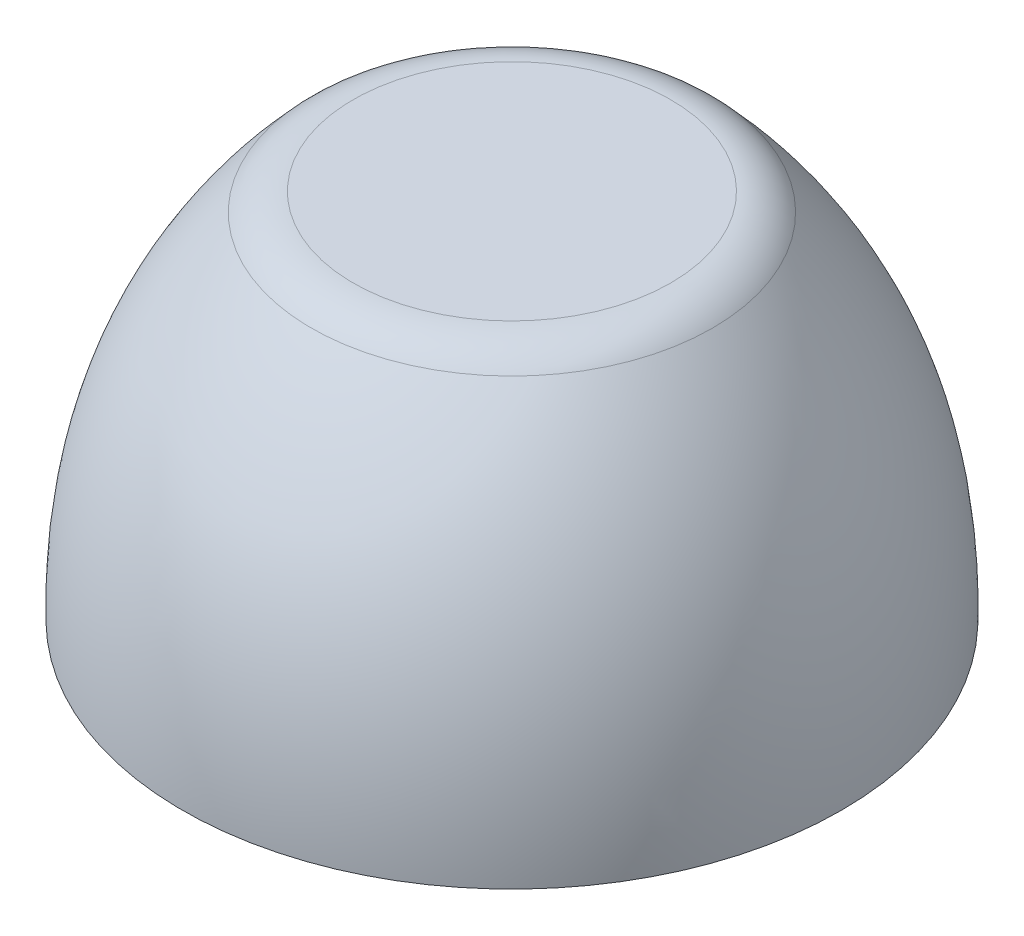
ISO-10303-21;
HEADER;
FILE_DESCRIPTION(('STEP AP214'),'2;1');
FILE_NAME('part.step','',(''),(''),'','','');
FILE_SCHEMA(('AUTOMOTIVE_DESIGN { 1 0 10303 214 1 1 1 1 }'));
ENDSEC;
DATA;
#1=APPLICATION_CONTEXT('core data for automotive mechanical design processes');
#2=APPLICATION_PROTOCOL_DEFINITION('international standard','automotive_design',2000,#1);
#3=PRODUCT_CONTEXT('',#1,'mechanical');
#4=PRODUCT('Part','Part','',(#3));
#5=PRODUCT_RELATED_PRODUCT_CATEGORY('part','',(#4));
#6=PRODUCT_DEFINITION_FORMATION('','',#4);
#7=PRODUCT_DEFINITION_CONTEXT('part definition',#1,'design');
#8=PRODUCT_DEFINITION('design','',#6,#7);
#9=PRODUCT_DEFINITION_SHAPE('','',#8);
#10=(LENGTH_UNIT() NAMED_UNIT(*) SI_UNIT(.MILLI.,.METRE.));
#11=(NAMED_UNIT(*) PLANE_ANGLE_UNIT() SI_UNIT($,.RADIAN.));
#12=(NAMED_UNIT(*) SI_UNIT($,.STERADIAN.) SOLID_ANGLE_UNIT());
#13=UNCERTAINTY_MEASURE_WITH_UNIT(LENGTH_MEASURE(1.E-05),#10,'distance_accuracy_value','');
#14=(GEOMETRIC_REPRESENTATION_CONTEXT(3) GLOBAL_UNCERTAINTY_ASSIGNED_CONTEXT((#13)) GLOBAL_UNIT_ASSIGNED_CONTEXT((#10,
#11,#12)) REPRESENTATION_CONTEXT('',''));
#15=CARTESIAN_POINT('',(0.,0.,0.));
#16=DIRECTION('',(0.,0.,1.));
#17=DIRECTION('',(1.,0.,0.));
#18=AXIS2_PLACEMENT_3D('',#15,#16,#17);
#19=CARTESIAN_POINT('',(-0.576727971236533,0.,0.));
#20=DIRECTION('',(0.,1.,0.));
#21=DIRECTION('',(-1.,0.,0.));
#22=AXIS2_PLACEMENT_3D('',#19,#20,#21);
#23=PLANE('',#22);
#24=CARTESIAN_POINT('',(0.,0.,0.));
#25=DIRECTION('',(0.,-1.,0.));
#26=DIRECTION('',(1.,0.,0.));
#27=AXIS2_PLACEMENT_3D('',#24,#25,#26);
#28=CIRCLE('',#27,0.576727971236533);
#29=CARTESIAN_POINT('',(0.576727971236533,0.,0.));
#30=VERTEX_POINT('',#29);
#31=EDGE_CURVE('E26',#30,#30,#28,.T.);
#32=ORIENTED_EDGE('',*,*,#31,.T.);
#33=EDGE_LOOP('',(#32));
#34=FACE_BOUND('',#33,.T.);
#35=ADVANCED_FACE('F15',(#34),#23,.F.);
#36=CARTESIAN_POINT('',(-0.32,0.65,0.));
#37=CARTESIAN_POINT('',(-0.58431537796571,0.392352938725328,0.));
#38=CARTESIAN_POINT('',(-0.576727971236533,0.,0.));
#39=B_SPLINE_CURVE_WITH_KNOTS('',2,(#36,#37,#38),.UNSPECIFIED.,.F.,.F.,(3,3),(0.,1.),.UNSPECIFIED.);
#40=CARTESIAN_POINT('',(0.,0.,0.));
#41=DIRECTION('',(0.,-1.,0.));
#42=AXIS1_PLACEMENT('',#40,#41);
#43=SURFACE_OF_REVOLUTION('',#39,#42);
#44=CARTESIAN_POINT('',(0.,0.618184487377835,0.));
#45=DIRECTION('',(0.,-1.,0.));
#46=DIRECTION('',(1.,0.,0.));
#47=AXIS2_PLACEMENT_3D('',#44,#45,#46);
#48=CIRCLE('',#47,0.351124131169325);
#49=CARTESIAN_POINT('',(0.351124131169325,0.618184487377835,0.));
#50=VERTEX_POINT('',#49);
#51=EDGE_CURVE('E22',#50,#50,#48,.T.);
#52=ORIENTED_EDGE('',*,*,#51,.T.);
#53=EDGE_LOOP('',(#52));
#54=FACE_BOUND('',#53,.T.);
#55=ORIENTED_EDGE('',*,*,#31,.F.);
#56=EDGE_LOOP('',(#55));
#57=FACE_BOUND('',#56,.T.);
#58=ADVANCED_FACE('F39',(#54,#57),#43,.T.);
#59=CARTESIAN_POINT('',(0.,0.65,0.));
#60=DIRECTION('',(0.,-1.,0.));
#61=DIRECTION('',(1.,0.,0.));
#62=AXIS2_PLACEMENT_3D('',#59,#60,#61);
#63=PLANE('',#62);
#64=CARTESIAN_POINT('',(0.,0.65,0.));
#65=DIRECTION('',(0.,-1.,0.));
#66=DIRECTION('',(1.,0.,0.));
#67=AXIS2_PLACEMENT_3D('',#64,#65,#66);
#68=CIRCLE('',#67,0.277974451190381);
#69=CARTESIAN_POINT('',(0.277974451190381,0.65,0.));
#70=VERTEX_POINT('',#69);
#71=EDGE_CURVE('E10',#70,#70,#68,.F.);
#72=ORIENTED_EDGE('',*,*,#71,.T.);
#73=EDGE_LOOP('',(#72));
#74=FACE_BOUND('',#73,.T.);
#75=ADVANCED_FACE('F42',(#74),#63,.F.);
#76=CARTESIAN_POINT('',(0.,0.55,0.));
#77=DIRECTION('',(0.,-1.,0.));
#78=DIRECTION('',(1.,0.,0.));
#79=AXIS2_PLACEMENT_3D('',#76,#77,#78);
#80=TOROIDAL_SURFACE('',#79,0.277974451190381,0.1);
#81=ORIENTED_EDGE('',*,*,#71,.F.);
#82=EDGE_LOOP('',(#81));
#83=FACE_BOUND('',#82,.T.);
#84=ORIENTED_EDGE('',*,*,#51,.F.);
#85=EDGE_LOOP('',(#84));
#86=FACE_BOUND('',#85,.T.);
#87=ADVANCED_FACE('F17',(#83,#86),#80,.T.);
#88=CLOSED_SHELL('',(#35,#58,#75,#87));
#89=MANIFOLD_SOLID_BREP('B1',#88);
#90=ADVANCED_BREP_SHAPE_REPRESENTATION('',(#18,#89),#14);
#91=SHAPE_DEFINITION_REPRESENTATION(#9,#90);
ENDSEC;
END-ISO-10303-21;
